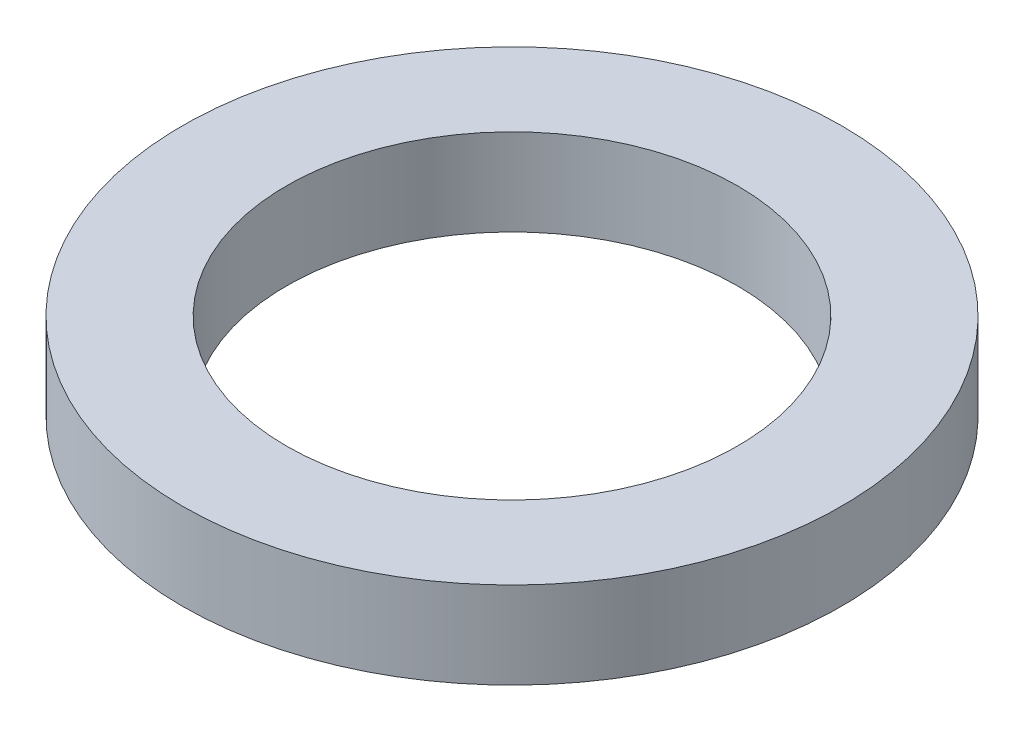
ISO-10303-21;
HEADER;
FILE_DESCRIPTION(('STEP AP214'),'2;1');
FILE_NAME('part.step','',(''),(''),'','','');
FILE_SCHEMA(('AUTOMOTIVE_DESIGN { 1 0 10303 214 1 1 1 1 }'));
ENDSEC;
DATA;
#1=APPLICATION_CONTEXT('core data for automotive mechanical design processes');
#2=APPLICATION_PROTOCOL_DEFINITION('international standard','automotive_design',2000,#1);
#3=PRODUCT_CONTEXT('',#1,'mechanical');
#4=PRODUCT('Part','Part','',(#3));
#5=PRODUCT_RELATED_PRODUCT_CATEGORY('part','',(#4));
#6=PRODUCT_DEFINITION_FORMATION('','',#4);
#7=PRODUCT_DEFINITION_CONTEXT('part definition',#1,'design');
#8=PRODUCT_DEFINITION('design','',#6,#7);
#9=PRODUCT_DEFINITION_SHAPE('','',#8);
#10=(LENGTH_UNIT() NAMED_UNIT(*) SI_UNIT(.MILLI.,.METRE.));
#11=(NAMED_UNIT(*) PLANE_ANGLE_UNIT() SI_UNIT($,.RADIAN.));
#12=(NAMED_UNIT(*) SI_UNIT($,.STERADIAN.) SOLID_ANGLE_UNIT());
#13=UNCERTAINTY_MEASURE_WITH_UNIT(LENGTH_MEASURE(1.E-05),#10,'distance_accuracy_value','');
#14=(GEOMETRIC_REPRESENTATION_CONTEXT(3) GLOBAL_UNCERTAINTY_ASSIGNED_CONTEXT((#13)) GLOBAL_UNIT_ASSIGNED_CONTEXT((#10,
#11,#12)) REPRESENTATION_CONTEXT('',''));
#15=CARTESIAN_POINT('',(0.,0.,0.));
#16=DIRECTION('',(0.,0.,1.));
#17=DIRECTION('',(1.,0.,0.));
#18=AXIS2_PLACEMENT_3D('',#15,#16,#17);
#19=CARTESIAN_POINT('',(0.,1.,0.));
#20=DIRECTION('',(0.,1.,0.));
#21=DIRECTION('',(0.,0.,1.));
#22=AXIS2_PLACEMENT_3D('',#19,#20,#21);
#23=PLANE('',#22);
#24=CARTESIAN_POINT('',(0.,1.,0.));
#25=DIRECTION('',(0.,1.,0.));
#26=DIRECTION('',(0.,0.,1.));
#27=AXIS2_PLACEMENT_3D('',#24,#25,#26);
#28=CIRCLE('',#27,3.8);
#29=CARTESIAN_POINT('',(0.,1.,3.8));
#30=VERTEX_POINT('',#29);
#31=EDGE_CURVE('E10',#30,#30,#28,.T.);
#32=ORIENTED_EDGE('',*,*,#31,.T.);
#33=EDGE_LOOP('',(#32));
#34=FACE_BOUND('',#33,.T.);
#35=CARTESIAN_POINT('',(0.,1.,0.));
#36=DIRECTION('',(0.,1.,0.));
#37=DIRECTION('',(0.,0.,1.));
#38=AXIS2_PLACEMENT_3D('',#35,#36,#37);
#39=CIRCLE('',#38,2.6);
#40=CARTESIAN_POINT('',(0.,1.,2.6));
#41=VERTEX_POINT('',#40);
#42=EDGE_CURVE('E43',#41,#41,#39,.T.);
#43=ORIENTED_EDGE('',*,*,#42,.F.);
#44=EDGE_LOOP('',(#43));
#45=FACE_BOUND('',#44,.T.);
#46=ADVANCED_FACE('F32',(#34,#45),#23,.T.);
#47=CARTESIAN_POINT('',(0.,0.,0.));
#48=DIRECTION('',(0.,1.,0.));
#49=DIRECTION('',(0.,0.,1.));
#50=AXIS2_PLACEMENT_3D('',#47,#48,#49);
#51=PLANE('',#50);
#52=CARTESIAN_POINT('',(0.,0.,0.));
#53=DIRECTION('',(0.,1.,0.));
#54=DIRECTION('',(0.,0.,1.));
#55=AXIS2_PLACEMENT_3D('',#52,#53,#54);
#56=CIRCLE('',#55,3.8);
#57=CARTESIAN_POINT('',(0.,0.,3.8));
#58=VERTEX_POINT('',#57);
#59=EDGE_CURVE('E36',#58,#58,#56,.T.);
#60=ORIENTED_EDGE('',*,*,#59,.F.);
#61=EDGE_LOOP('',(#60));
#62=FACE_BOUND('',#61,.T.);
#63=CARTESIAN_POINT('',(0.,0.,0.));
#64=DIRECTION('',(0.,1.,0.));
#65=DIRECTION('',(0.,0.,1.));
#66=AXIS2_PLACEMENT_3D('',#63,#64,#65);
#67=CIRCLE('',#66,2.6);
#68=CARTESIAN_POINT('',(0.,0.,2.6));
#69=VERTEX_POINT('',#68);
#70=EDGE_CURVE('E45',#69,#69,#67,.T.);
#71=ORIENTED_EDGE('',*,*,#70,.T.);
#72=EDGE_LOOP('',(#71));
#73=FACE_BOUND('',#72,.T.);
#74=ADVANCED_FACE('F55',(#62,#73),#51,.F.);
#75=CARTESIAN_POINT('',(0.,1.,0.));
#76=DIRECTION('',(0.,-1.,0.));
#77=DIRECTION('',(0.,0.,-1.));
#78=AXIS2_PLACEMENT_3D('',#75,#76,#77);
#79=CYLINDRICAL_SURFACE('',#78,3.8);
#80=ORIENTED_EDGE('',*,*,#31,.F.);
#81=EDGE_LOOP('',(#80));
#82=FACE_BOUND('',#81,.T.);
#83=ORIENTED_EDGE('',*,*,#59,.T.);
#84=EDGE_LOOP('',(#83));
#85=FACE_BOUND('',#84,.T.);
#86=ADVANCED_FACE('F34',(#82,#85),#79,.T.);
#87=CARTESIAN_POINT('',(0.,1.,0.));
#88=DIRECTION('',(0.,-1.,0.));
#89=DIRECTION('',(0.,0.,-1.));
#90=AXIS2_PLACEMENT_3D('',#87,#88,#89);
#91=CYLINDRICAL_SURFACE('',#90,2.6);
#92=ORIENTED_EDGE('',*,*,#42,.T.);
#93=EDGE_LOOP('',(#92));
#94=FACE_BOUND('',#93,.T.);
#95=ORIENTED_EDGE('',*,*,#70,.F.);
#96=EDGE_LOOP('',(#95));
#97=FACE_BOUND('',#96,.T.);
#98=ADVANCED_FACE('F51',(#94,#97),#91,.F.);
#99=CLOSED_SHELL('',(#46,#74,#86,#98));
#100=MANIFOLD_SOLID_BREP('B2',#99);
#101=ADVANCED_BREP_SHAPE_REPRESENTATION('',(#18,#100),#14);
#102=SHAPE_DEFINITION_REPRESENTATION(#9,#101);
ENDSEC;
END-ISO-10303-21;
